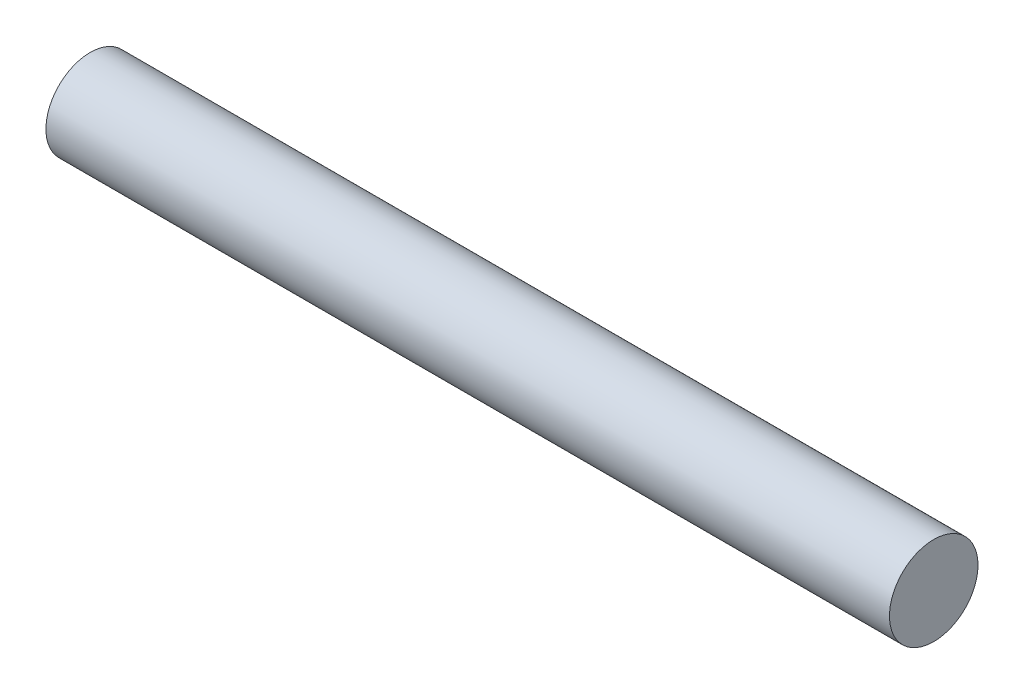
ISO-10303-21;
HEADER;
FILE_DESCRIPTION(('STEP AP214'),'2;1');
FILE_NAME('part.step','',(''),(''),'','','');
FILE_SCHEMA(('AUTOMOTIVE_DESIGN { 1 0 10303 214 1 1 1 1 }'));
ENDSEC;
DATA;
#1=APPLICATION_CONTEXT('core data for automotive mechanical design processes');
#2=APPLICATION_PROTOCOL_DEFINITION('international standard','automotive_design',2000,#1);
#3=PRODUCT_CONTEXT('',#1,'mechanical');
#4=PRODUCT('Part','Part','',(#3));
#5=PRODUCT_RELATED_PRODUCT_CATEGORY('part','',(#4));
#6=PRODUCT_DEFINITION_FORMATION('','',#4);
#7=PRODUCT_DEFINITION_CONTEXT('part definition',#1,'design');
#8=PRODUCT_DEFINITION('design','',#6,#7);
#9=PRODUCT_DEFINITION_SHAPE('','',#8);
#10=(LENGTH_UNIT() NAMED_UNIT(*) SI_UNIT(.MILLI.,.METRE.));
#11=(NAMED_UNIT(*) PLANE_ANGLE_UNIT() SI_UNIT($,.RADIAN.));
#12=(NAMED_UNIT(*) SI_UNIT($,.STERADIAN.) SOLID_ANGLE_UNIT());
#13=UNCERTAINTY_MEASURE_WITH_UNIT(LENGTH_MEASURE(1.E-05),#10,'distance_accuracy_value','');
#14=(GEOMETRIC_REPRESENTATION_CONTEXT(3) GLOBAL_UNCERTAINTY_ASSIGNED_CONTEXT((#13)) GLOBAL_UNIT_ASSIGNED_CONTEXT((#10,
#11,#12)) REPRESENTATION_CONTEXT('',''));
#15=CARTESIAN_POINT('',(0.,0.,0.));
#16=DIRECTION('',(0.,0.,1.));
#17=DIRECTION('',(1.,0.,0.));
#18=AXIS2_PLACEMENT_3D('',#15,#16,#17);
#19=CARTESIAN_POINT('',(15.12712649,0.,0.));
#20=DIRECTION('',(-1.,0.,0.));
#21=DIRECTION('',(0.,0.,1.));
#22=AXIS2_PLACEMENT_3D('',#19,#20,#21);
#23=CYLINDRICAL_SURFACE('',#22,1.5875);
#24=CARTESIAN_POINT('',(15.12712649,0.,0.));
#25=DIRECTION('',(1.,0.,0.));
#26=DIRECTION('',(0.,0.,-1.));
#27=AXIS2_PLACEMENT_3D('',#24,#25,#26);
#28=CIRCLE('',#27,1.5875);
#29=CARTESIAN_POINT('',(15.12712649,0.,-1.5875));
#30=VERTEX_POINT('',#29);
#31=EDGE_CURVE('E10',#30,#30,#28,.T.);
#32=ORIENTED_EDGE('',*,*,#31,.F.);
#33=EDGE_LOOP('',(#32));
#34=FACE_BOUND('',#33,.T.);
#35=CARTESIAN_POINT('',(-15.12712649,0.,0.));
#36=DIRECTION('',(1.,0.,0.));
#37=DIRECTION('',(0.,0.,-1.));
#38=AXIS2_PLACEMENT_3D('',#35,#36,#37);
#39=CIRCLE('',#38,1.5875);
#40=CARTESIAN_POINT('',(-15.12712649,0.,-1.5875));
#41=VERTEX_POINT('',#40);
#42=EDGE_CURVE('E36',#41,#41,#39,.T.);
#43=ORIENTED_EDGE('',*,*,#42,.T.);
#44=EDGE_LOOP('',(#43));
#45=FACE_BOUND('',#44,.T.);
#46=ADVANCED_FACE('F33',(#34,#45),#23,.T.);
#47=CARTESIAN_POINT('',(15.12712649,0.,0.));
#48=DIRECTION('',(1.,0.,0.));
#49=DIRECTION('',(0.,0.,-1.));
#50=AXIS2_PLACEMENT_3D('',#47,#48,#49);
#51=PLANE('',#50);
#52=ORIENTED_EDGE('',*,*,#31,.T.);
#53=EDGE_LOOP('',(#52));
#54=FACE_BOUND('',#53,.T.);
#55=ADVANCED_FACE('F48',(#54),#51,.T.);
#56=CARTESIAN_POINT('',(-15.12712649,0.,0.));
#57=DIRECTION('',(1.,0.,0.));
#58=DIRECTION('',(0.,0.,-1.));
#59=AXIS2_PLACEMENT_3D('',#56,#57,#58);
#60=PLANE('',#59);
#61=ORIENTED_EDGE('',*,*,#42,.F.);
#62=EDGE_LOOP('',(#61));
#63=FACE_BOUND('',#62,.T.);
#64=ADVANCED_FACE('F46',(#63),#60,.F.);
#65=CLOSED_SHELL('',(#46,#55,#64));
#66=MANIFOLD_SOLID_BREP('B2',#65);
#67=ADVANCED_BREP_SHAPE_REPRESENTATION('',(#18,#66),#14);
#68=SHAPE_DEFINITION_REPRESENTATION(#9,#67);
ENDSEC;
END-ISO-10303-21;
